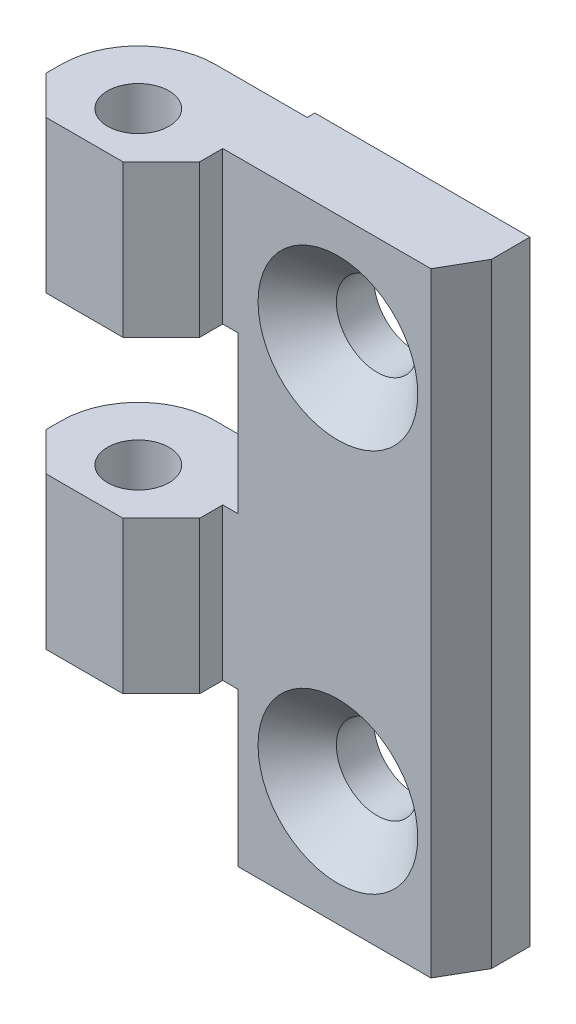
ISO-10303-21;
HEADER;
FILE_DESCRIPTION(('STEP AP214'),'2;1');
FILE_NAME('part.step','',(''),(''),'','','');
FILE_SCHEMA(('AUTOMOTIVE_DESIGN { 1 0 10303 214 1 1 1 1 }'));
ENDSEC;
DATA;
#1=APPLICATION_CONTEXT('core data for automotive mechanical design processes');
#2=APPLICATION_PROTOCOL_DEFINITION('international standard','automotive_design',2000,#1);
#3=PRODUCT_CONTEXT('',#1,'mechanical');
#4=PRODUCT('Part','Part','',(#3));
#5=PRODUCT_RELATED_PRODUCT_CATEGORY('part','',(#4));
#6=PRODUCT_DEFINITION_FORMATION('','',#4);
#7=PRODUCT_DEFINITION_CONTEXT('part definition',#1,'design');
#8=PRODUCT_DEFINITION('design','',#6,#7);
#9=PRODUCT_DEFINITION_SHAPE('','',#8);
#10=(LENGTH_UNIT() NAMED_UNIT(*) SI_UNIT(.MILLI.,.METRE.));
#11=(NAMED_UNIT(*) PLANE_ANGLE_UNIT() SI_UNIT($,.RADIAN.));
#12=(NAMED_UNIT(*) SI_UNIT($,.STERADIAN.) SOLID_ANGLE_UNIT());
#13=UNCERTAINTY_MEASURE_WITH_UNIT(LENGTH_MEASURE(1.E-05),#10,'distance_accuracy_value','');
#14=(GEOMETRIC_REPRESENTATION_CONTEXT(3) GLOBAL_UNCERTAINTY_ASSIGNED_CONTEXT((#13)) GLOBAL_UNIT_ASSIGNED_CONTEXT((#10,
#11,#12)) REPRESENTATION_CONTEXT('',''));
#15=CARTESIAN_POINT('',(0.,0.,0.));
#16=DIRECTION('',(0.,0.,1.));
#17=DIRECTION('',(1.,0.,0.));
#18=AXIS2_PLACEMENT_3D('',#15,#16,#17);
#19=CARTESIAN_POINT('',(-2.5,40.,0.));
#20=DIRECTION('',(0.707106781186548,0.,-0.707106781186548));
#21=DIRECTION('',(-0.707106781186548,0.,-0.707106781186548));
#22=AXIS2_PLACEMENT_3D('',#19,#20,#21);
#23=PLANE('',#22);
#24=DIRECTION('',(-0.707106781186548,0.,-0.707106781186548));
#25=VECTOR('',#24,1.);
#26=CARTESIAN_POINT('',(-2.5,10.,0.));
#27=LINE('',#26,#25);
#28=CARTESIAN_POINT('',(-2.5,10.,0.));
#29=VERTEX_POINT('',#28);
#30=CARTESIAN_POINT('',(-5.,10.,-2.5));
#31=VERTEX_POINT('',#30);
#32=EDGE_CURVE('E51',#29,#31,#27,.T.);
#33=ORIENTED_EDGE('',*,*,#32,.F.);
#34=DIRECTION('',(0.,-1.,0.));
#35=VECTOR('',#34,1.);
#36=CARTESIAN_POINT('',(-2.5,40.,0.));
#37=LINE('',#36,#35);
#38=CARTESIAN_POINT('',(-2.5,19.9,0.));
#39=VERTEX_POINT('',#38);
#40=EDGE_CURVE('E227',#39,#29,#37,.T.);
#41=ORIENTED_EDGE('',*,*,#40,.F.);
#42=DIRECTION('',(0.707106781186548,0.,0.707106781186548));
#43=VECTOR('',#42,1.);
#44=CARTESIAN_POINT('',(-2.5,19.9,0.));
#45=LINE('',#44,#43);
#46=CARTESIAN_POINT('',(-5.,19.9,-2.5));
#47=VERTEX_POINT('',#46);
#48=EDGE_CURVE('E247',#47,#39,#45,.T.);
#49=ORIENTED_EDGE('',*,*,#48,.F.);
#50=DIRECTION('',(0.,-1.,0.));
#51=VECTOR('',#50,1.);
#52=CARTESIAN_POINT('',(-5.,40.,-2.5));
#53=LINE('',#52,#51);
#54=EDGE_CURVE('E336',#47,#31,#53,.T.);
#55=ORIENTED_EDGE('',*,*,#54,.T.);
#56=EDGE_LOOP('',(#33,#41,#49,#55));
#57=FACE_BOUND('',#56,.T.);
#58=ADVANCED_FACE('F34',(#57),#23,.F.);
#59=CARTESIAN_POINT('',(-2.5,40.,0.));
#60=DIRECTION('',(0.,0.,-1.));
#61=DIRECTION('',(-1.,0.,0.));
#62=AXIS2_PLACEMENT_3D('',#59,#60,#61);
#63=PLANE('',#62);
#64=DIRECTION('',(-1.,0.,0.));
#65=VECTOR('',#64,1.);
#66=CARTESIAN_POINT('',(-2.5,10.,0.));
#67=LINE('',#66,#65);
#68=CARTESIAN_POINT('',(2.5,10.,0.));
#69=VERTEX_POINT('',#68);
#70=EDGE_CURVE('E428',#69,#29,#67,.T.);
#71=ORIENTED_EDGE('',*,*,#70,.F.);
#72=DIRECTION('',(0.,-1.,0.));
#73=VECTOR('',#72,1.);
#74=CARTESIAN_POINT('',(2.5,40.,0.));
#75=LINE('',#74,#73);
#76=CARTESIAN_POINT('',(2.5,19.9,0.));
#77=VERTEX_POINT('',#76);
#78=EDGE_CURVE('E223',#77,#69,#75,.T.);
#79=ORIENTED_EDGE('',*,*,#78,.F.);
#80=DIRECTION('',(1.,0.,0.));
#81=VECTOR('',#80,1.);
#82=CARTESIAN_POINT('',(-2.5,19.9,0.));
#83=LINE('',#82,#81);
#84=EDGE_CURVE('E249',#39,#77,#83,.T.);
#85=ORIENTED_EDGE('',*,*,#84,.F.);
#86=ORIENTED_EDGE('',*,*,#40,.T.);
#87=EDGE_LOOP('',(#71,#79,#85,#86));
#88=FACE_BOUND('',#87,.T.);
#89=ADVANCED_FACE('F457',(#88),#63,.F.);
#90=CARTESIAN_POINT('',(2.5,40.,0.));
#91=DIRECTION('',(-0.707106781186548,0.,-0.707106781186548));
#92=DIRECTION('',(-0.707106781186548,0.,0.707106781186548));
#93=AXIS2_PLACEMENT_3D('',#90,#91,#92);
#94=PLANE('',#93);
#95=DIRECTION('',(-0.707106781186548,0.,0.707106781186548));
#96=VECTOR('',#95,1.);
#97=CARTESIAN_POINT('',(2.5,10.,0.));
#98=LINE('',#97,#96);
#99=CARTESIAN_POINT('',(5.,10.,-2.5));
#100=VERTEX_POINT('',#99);
#101=EDGE_CURVE('E193',#100,#69,#98,.T.);
#102=ORIENTED_EDGE('',*,*,#101,.F.);
#103=DIRECTION('',(0.,-1.,0.));
#104=VECTOR('',#103,1.);
#105=CARTESIAN_POINT('',(5.,40.,-2.5));
#106=LINE('',#105,#104);
#107=CARTESIAN_POINT('',(5.,19.9,-2.5));
#108=VERTEX_POINT('',#107);
#109=EDGE_CURVE('E191',#108,#100,#106,.T.);
#110=ORIENTED_EDGE('',*,*,#109,.F.);
#111=DIRECTION('',(0.707106781186548,0.,-0.707106781186548));
#112=VECTOR('',#111,1.);
#113=CARTESIAN_POINT('',(2.5,19.9,0.));
#114=LINE('',#113,#112);
#115=EDGE_CURVE('E251',#77,#108,#114,.T.);
#116=ORIENTED_EDGE('',*,*,#115,.F.);
#117=ORIENTED_EDGE('',*,*,#78,.T.);
#118=EDGE_LOOP('',(#102,#110,#116,#117));
#119=FACE_BOUND('',#118,.T.);
#120=ADVANCED_FACE('F424',(#119),#94,.F.);
#121=CARTESIAN_POINT('',(5.,40.,-2.5));
#122=DIRECTION('',(-1.,0.,0.));
#123=DIRECTION('',(0.,0.,1.));
#124=AXIS2_PLACEMENT_3D('',#121,#122,#123);
#125=PLANE('',#124);
#126=DIRECTION('',(0.,0.,1.));
#127=VECTOR('',#126,1.);
#128=CARTESIAN_POINT('',(5.,10.,-2.5));
#129=LINE('',#128,#127);
#130=CARTESIAN_POINT('',(5.,10.,-4.));
#131=VERTEX_POINT('',#130);
#132=EDGE_CURVE('E184',#131,#100,#129,.T.);
#133=ORIENTED_EDGE('',*,*,#132,.F.);
#134=DIRECTION('',(0.,-1.,0.));
#135=VECTOR('',#134,1.);
#136=CARTESIAN_POINT('',(5.,40.,-4.));
#137=LINE('',#136,#135);
#138=CARTESIAN_POINT('',(5.,19.9,-4.));
#139=VERTEX_POINT('',#138);
#140=EDGE_CURVE('E189',#139,#131,#137,.T.);
#141=ORIENTED_EDGE('',*,*,#140,.F.);
#142=DIRECTION('',(0.,0.,-1.));
#143=VECTOR('',#142,1.);
#144=CARTESIAN_POINT('',(5.,19.9,-2.5));
#145=LINE('',#144,#143);
#146=EDGE_CURVE('E253',#108,#139,#145,.T.);
#147=ORIENTED_EDGE('',*,*,#146,.F.);
#148=ORIENTED_EDGE('',*,*,#109,.T.);
#149=EDGE_LOOP('',(#133,#141,#147,#148));
#150=FACE_BOUND('',#149,.T.);
#151=ADVANCED_FACE('F186',(#150),#125,.F.);
#152=CARTESIAN_POINT('',(0.,40.,-8.5));
#153=DIRECTION('',(0.,0.,1.));
#154=DIRECTION('',(1.,0.,0.));
#155=AXIS2_PLACEMENT_3D('',#152,#153,#154);
#156=PLANE('',#155);
#157=DIRECTION('',(-1.,0.,0.));
#158=VECTOR('',#157,1.);
#159=CARTESIAN_POINT('',(0.,10.,-8.5));
#160=LINE('',#159,#158);
#161=CARTESIAN_POINT('',(6.,10.,-8.5));
#162=VERTEX_POINT('',#161);
#163=CARTESIAN_POINT('',(0.,10.,-8.5));
#164=VERTEX_POINT('',#163);
#165=EDGE_CURVE('E235',#162,#164,#160,.T.);
#166=ORIENTED_EDGE('',*,*,#165,.T.);
#167=DIRECTION('',(0.,-1.,0.));
#168=VECTOR('',#167,1.);
#169=CARTESIAN_POINT('',(0.,40.,-8.5));
#170=LINE('',#169,#168);
#171=CARTESIAN_POINT('',(0.,19.9,-8.5));
#172=VERTEX_POINT('',#171);
#173=EDGE_CURVE('E351',#172,#164,#170,.T.);
#174=ORIENTED_EDGE('',*,*,#173,.F.);
#175=DIRECTION('',(1.,0.,0.));
#176=VECTOR('',#175,1.);
#177=CARTESIAN_POINT('',(0.,19.9,-8.5));
#178=LINE('',#177,#176);
#179=CARTESIAN_POINT('',(6.,19.9,-8.5));
#180=VERTEX_POINT('',#179);
#181=EDGE_CURVE('E43',#172,#180,#178,.T.);
#182=ORIENTED_EDGE('',*,*,#181,.T.);
#183=DIRECTION('',(0.,-1.,0.));
#184=VECTOR('',#183,1.);
#185=CARTESIAN_POINT('',(6.,40.,-8.5));
#186=LINE('',#185,#184);
#187=EDGE_CURVE('E355',#180,#162,#186,.T.);
#188=ORIENTED_EDGE('',*,*,#187,.T.);
#189=EDGE_LOOP('',(#166,#174,#182,#188));
#190=FACE_BOUND('',#189,.T.);
#191=ADVANCED_FACE('F440',(#190),#156,.F.);
#192=CARTESIAN_POINT('',(0.,40.,-3.49999999999998));
#193=DIRECTION('',(0.,-1.,0.));
#194=DIRECTION('',(0.,0.,-1.));
#195=AXIS2_PLACEMENT_3D('',#192,#193,#194);
#196=CYLINDRICAL_SURFACE('',#195,5.00000000000002);
#197=CARTESIAN_POINT('',(0.,10.,-3.49999999999998));
#198=DIRECTION('',(0.,-1.,0.));
#199=DIRECTION('',(0.,0.,-1.));
#200=AXIS2_PLACEMENT_3D('',#197,#198,#199);
#201=CIRCLE('',#200,5.00000000000002);
#202=CARTESIAN_POINT('',(-5.,10.,-3.5));
#203=VERTEX_POINT('',#202);
#204=EDGE_CURVE('E435',#203,#164,#201,.T.);
#205=ORIENTED_EDGE('',*,*,#204,.F.);
#206=DIRECTION('',(0.,-1.,0.));
#207=VECTOR('',#206,1.);
#208=CARTESIAN_POINT('',(-5.,40.,-3.5));
#209=LINE('',#208,#207);
#210=CARTESIAN_POINT('',(-5.,19.9,-3.5));
#211=VERTEX_POINT('',#210);
#212=EDGE_CURVE('E347',#211,#203,#209,.T.);
#213=ORIENTED_EDGE('',*,*,#212,.F.);
#214=CARTESIAN_POINT('',(0.,19.9,-3.49999999999998));
#215=DIRECTION('',(0.,1.,0.));
#216=DIRECTION('',(0.,0.,1.));
#217=AXIS2_PLACEMENT_3D('',#214,#215,#216);
#218=CIRCLE('',#217,5.00000000000002);
#219=EDGE_CURVE('E59',#172,#211,#218,.T.);
#220=ORIENTED_EDGE('',*,*,#219,.F.);
#221=ORIENTED_EDGE('',*,*,#173,.T.);
#222=EDGE_LOOP('',(#205,#213,#220,#221));
#223=FACE_BOUND('',#222,.T.);
#224=ADVANCED_FACE('F445',(#223),#196,.T.);
#225=CARTESIAN_POINT('',(-5.,40.,-2.5));
#226=DIRECTION('',(1.,0.,0.));
#227=DIRECTION('',(0.,0.,-1.));
#228=AXIS2_PLACEMENT_3D('',#225,#226,#227);
#229=PLANE('',#228);
#230=DIRECTION('',(0.,0.,-1.));
#231=VECTOR('',#230,1.);
#232=CARTESIAN_POINT('',(-5.,10.,-2.5));
#233=LINE('',#232,#231);
#234=EDGE_CURVE('E433',#31,#203,#233,.T.);
#235=ORIENTED_EDGE('',*,*,#234,.F.);
#236=ORIENTED_EDGE('',*,*,#54,.F.);
#237=DIRECTION('',(0.,0.,1.));
#238=VECTOR('',#237,1.);
#239=CARTESIAN_POINT('',(-5.,19.9,-2.5));
#240=LINE('',#239,#238);
#241=EDGE_CURVE('E234',#211,#47,#240,.T.);
#242=ORIENTED_EDGE('',*,*,#241,.F.);
#243=ORIENTED_EDGE('',*,*,#212,.T.);
#244=EDGE_LOOP('',(#235,#236,#242,#243));
#245=FACE_BOUND('',#244,.T.);
#246=ADVANCED_FACE('F448',(#245),#229,.F.);
#247=CARTESIAN_POINT('',(0.,0.,-3.49999999999998));
#248=DIRECTION('',(0.,1.,0.));
#249=DIRECTION('',(0.,0.,1.));
#250=AXIS2_PLACEMENT_3D('',#247,#248,#249);
#251=CYLINDRICAL_SURFACE('',#250,2.);
#252=CARTESIAN_POINT('',(0.,19.9,-3.49999999999998));
#253=DIRECTION('',(0.,1.,0.));
#254=DIRECTION('',(0.,0.,1.));
#255=AXIS2_PLACEMENT_3D('',#252,#253,#254);
#256=CIRCLE('',#255,2.);
#257=CARTESIAN_POINT('',(0.,19.9,-1.49999999999998));
#258=VERTEX_POINT('',#257);
#259=EDGE_CURVE('E232',#258,#258,#256,.F.);
#260=ORIENTED_EDGE('',*,*,#259,.F.);
#261=EDGE_LOOP('',(#260));
#262=FACE_BOUND('',#261,.T.);
#263=CARTESIAN_POINT('',(0.,10.,-3.49999999999998));
#264=DIRECTION('',(0.,-1.,0.));
#265=DIRECTION('',(0.,0.,-1.));
#266=AXIS2_PLACEMENT_3D('',#263,#264,#265);
#267=CIRCLE('',#266,2.);
#268=CARTESIAN_POINT('',(0.,10.,-5.49999999999998));
#269=VERTEX_POINT('',#268);
#270=EDGE_CURVE('E437',#269,#269,#267,.F.);
#271=ORIENTED_EDGE('',*,*,#270,.F.);
#272=EDGE_LOOP('',(#271));
#273=FACE_BOUND('',#272,.T.);
#274=ADVANCED_FACE('F469',(#262,#273),#251,.F.);
#275=DIRECTION('',(-0.707106781186548,0.,-0.707106781186548));
#276=VECTOR('',#275,1.);
#277=CARTESIAN_POINT('',(-2.5,30.1,0.));
#278=LINE('',#277,#276);
#279=CARTESIAN_POINT('',(-2.5,30.1,0.));
#280=VERTEX_POINT('',#279);
#281=CARTESIAN_POINT('',(-5.,30.1,-2.5));
#282=VERTEX_POINT('',#281);
#283=EDGE_CURVE('E260',#280,#282,#278,.T.);
#284=ORIENTED_EDGE('',*,*,#283,.F.);
#285=CARTESIAN_POINT('',(-2.5,40.,0.));
#286=VERTEX_POINT('',#285);
#287=EDGE_CURVE('E228',#286,#280,#37,.T.);
#288=ORIENTED_EDGE('',*,*,#287,.F.);
#289=DIRECTION('',(0.707106781186548,0.,0.707106781186548));
#290=VECTOR('',#289,1.);
#291=CARTESIAN_POINT('',(-2.5,40.,0.));
#292=LINE('',#291,#290);
#293=CARTESIAN_POINT('',(-5.,40.,-2.5));
#294=VERTEX_POINT('',#293);
#295=EDGE_CURVE('E311',#294,#286,#292,.T.);
#296=ORIENTED_EDGE('',*,*,#295,.F.);
#297=EDGE_CURVE('E344',#294,#282,#53,.T.);
#298=ORIENTED_EDGE('',*,*,#297,.T.);
#299=EDGE_LOOP('',(#284,#288,#296,#298));
#300=FACE_BOUND('',#299,.T.);
#301=ADVANCED_FACE('F36',(#300),#23,.F.);
#302=DIRECTION('',(-1.,0.,0.));
#303=VECTOR('',#302,1.);
#304=CARTESIAN_POINT('',(-2.5,30.1,0.));
#305=LINE('',#304,#303);
#306=CARTESIAN_POINT('',(2.5,30.1,0.));
#307=VERTEX_POINT('',#306);
#308=EDGE_CURVE('E265',#307,#280,#305,.T.);
#309=ORIENTED_EDGE('',*,*,#308,.F.);
#310=CARTESIAN_POINT('',(2.5,40.,0.));
#311=VERTEX_POINT('',#310);
#312=EDGE_CURVE('E224',#311,#307,#75,.T.);
#313=ORIENTED_EDGE('',*,*,#312,.F.);
#314=DIRECTION('',(1.,0.,0.));
#315=VECTOR('',#314,1.);
#316=CARTESIAN_POINT('',(-2.5,40.,0.));
#317=LINE('',#316,#315);
#318=EDGE_CURVE('E314',#286,#311,#317,.T.);
#319=ORIENTED_EDGE('',*,*,#318,.F.);
#320=ORIENTED_EDGE('',*,*,#287,.T.);
#321=EDGE_LOOP('',(#309,#313,#319,#320));
#322=FACE_BOUND('',#321,.T.);
#323=ADVANCED_FACE('F405',(#322),#63,.F.);
#324=DIRECTION('',(-0.707106781186548,0.,0.707106781186548));
#325=VECTOR('',#324,1.);
#326=CARTESIAN_POINT('',(2.5,30.1,0.));
#327=LINE('',#326,#325);
#328=CARTESIAN_POINT('',(5.,30.1,-2.5));
#329=VERTEX_POINT('',#328);
#330=EDGE_CURVE('E263',#329,#307,#327,.T.);
#331=ORIENTED_EDGE('',*,*,#330,.F.);
#332=CARTESIAN_POINT('',(5.,40.,-2.5));
#333=VERTEX_POINT('',#332);
#334=EDGE_CURVE('E220',#333,#329,#106,.T.);
#335=ORIENTED_EDGE('',*,*,#334,.F.);
#336=DIRECTION('',(0.707106781186548,0.,-0.707106781186548));
#337=VECTOR('',#336,1.);
#338=CARTESIAN_POINT('',(2.5,40.,0.));
#339=LINE('',#338,#337);
#340=EDGE_CURVE('E317',#311,#333,#339,.T.);
#341=ORIENTED_EDGE('',*,*,#340,.F.);
#342=ORIENTED_EDGE('',*,*,#312,.T.);
#343=EDGE_LOOP('',(#331,#335,#341,#342));
#344=FACE_BOUND('',#343,.T.);
#345=ADVANCED_FACE('F413',(#344),#94,.F.);
#346=DIRECTION('',(0.,0.,1.));
#347=VECTOR('',#346,1.);
#348=CARTESIAN_POINT('',(5.,30.1,-2.5));
#349=LINE('',#348,#347);
#350=CARTESIAN_POINT('',(5.,30.1,-4.));
#351=VERTEX_POINT('',#350);
#352=EDGE_CURVE('E261',#351,#329,#349,.T.);
#353=ORIENTED_EDGE('',*,*,#352,.F.);
#354=CARTESIAN_POINT('',(5.,40.,-4.));
#355=VERTEX_POINT('',#354);
#356=EDGE_CURVE('E211',#355,#351,#137,.T.);
#357=ORIENTED_EDGE('',*,*,#356,.F.);
#358=DIRECTION('',(0.,0.,-1.));
#359=VECTOR('',#358,1.);
#360=CARTESIAN_POINT('',(5.,40.,-2.5));
#361=LINE('',#360,#359);
#362=EDGE_CURVE('E319',#333,#355,#361,.T.);
#363=ORIENTED_EDGE('',*,*,#362,.F.);
#364=ORIENTED_EDGE('',*,*,#334,.T.);
#365=EDGE_LOOP('',(#353,#357,#363,#364));
#366=FACE_BOUND('',#365,.T.);
#367=ADVANCED_FACE('F415',(#366),#125,.F.);
#368=DIRECTION('',(-1.,0.,0.));
#369=VECTOR('',#368,1.);
#370=CARTESIAN_POINT('',(0.,30.1,-8.5));
#371=LINE('',#370,#369);
#372=CARTESIAN_POINT('',(6.,30.1,-8.5));
#373=VERTEX_POINT('',#372);
#374=CARTESIAN_POINT('',(0.,30.1,-8.5));
#375=VERTEX_POINT('',#374);
#376=EDGE_CURVE('E11',#373,#375,#371,.T.);
#377=ORIENTED_EDGE('',*,*,#376,.T.);
#378=CARTESIAN_POINT('',(0.,40.,-8.5));
#379=VERTEX_POINT('',#378);
#380=EDGE_CURVE('E352',#379,#375,#170,.T.);
#381=ORIENTED_EDGE('',*,*,#380,.F.);
#382=DIRECTION('',(-1.,0.,0.));
#383=VECTOR('',#382,1.);
#384=CARTESIAN_POINT('',(0.,40.,-8.5));
#385=LINE('',#384,#383);
#386=CARTESIAN_POINT('',(6.,40.,-8.5));
#387=VERTEX_POINT('',#386);
#388=EDGE_CURVE('E330',#387,#379,#385,.T.);
#389=ORIENTED_EDGE('',*,*,#388,.F.);
#390=EDGE_CURVE('E356',#387,#373,#186,.T.);
#391=ORIENTED_EDGE('',*,*,#390,.T.);
#392=EDGE_LOOP('',(#377,#381,#389,#391));
#393=FACE_BOUND('',#392,.T.);
#394=ADVANCED_FACE('F388',(#393),#156,.F.);
#395=CARTESIAN_POINT('',(0.,30.1,-3.49999999999998));
#396=DIRECTION('',(0.,-1.,0.));
#397=DIRECTION('',(0.,0.,-1.));
#398=AXIS2_PLACEMENT_3D('',#395,#396,#397);
#399=CIRCLE('',#398,5.00000000000002);
#400=CARTESIAN_POINT('',(-5.,30.1,-3.5));
#401=VERTEX_POINT('',#400);
#402=EDGE_CURVE('E257',#401,#375,#399,.T.);
#403=ORIENTED_EDGE('',*,*,#402,.F.);
#404=CARTESIAN_POINT('',(-5.,40.,-3.5));
#405=VERTEX_POINT('',#404);
#406=EDGE_CURVE('E348',#405,#401,#209,.T.);
#407=ORIENTED_EDGE('',*,*,#406,.F.);
#408=CARTESIAN_POINT('',(0.,40.,-3.49999999999998));
#409=DIRECTION('',(0.,1.,0.));
#410=DIRECTION('',(0.,0.,-1.));
#411=AXIS2_PLACEMENT_3D('',#408,#409,#410);
#412=CIRCLE('',#411,5.00000000000002);
#413=EDGE_CURVE('E332',#379,#405,#412,.T.);
#414=ORIENTED_EDGE('',*,*,#413,.F.);
#415=ORIENTED_EDGE('',*,*,#380,.T.);
#416=EDGE_LOOP('',(#403,#407,#414,#415));
#417=FACE_BOUND('',#416,.T.);
#418=ADVANCED_FACE('F393',(#417),#196,.T.);
#419=DIRECTION('',(0.,0.,-1.));
#420=VECTOR('',#419,1.);
#421=CARTESIAN_POINT('',(-5.,30.1,-2.5));
#422=LINE('',#421,#420);
#423=EDGE_CURVE('E255',#282,#401,#422,.T.);
#424=ORIENTED_EDGE('',*,*,#423,.F.);
#425=ORIENTED_EDGE('',*,*,#297,.F.);
#426=DIRECTION('',(0.,0.,1.));
#427=VECTOR('',#426,1.);
#428=CARTESIAN_POINT('',(-5.,40.,-2.5));
#429=LINE('',#428,#427);
#430=EDGE_CURVE('E334',#405,#294,#429,.T.);
#431=ORIENTED_EDGE('',*,*,#430,.F.);
#432=ORIENTED_EDGE('',*,*,#406,.T.);
#433=EDGE_LOOP('',(#424,#425,#431,#432));
#434=FACE_BOUND('',#433,.T.);
#435=ADVANCED_FACE('F400',(#434),#229,.F.);
#436=CARTESIAN_POINT('',(0.,40.,-3.49999999999998));
#437=DIRECTION('',(0.,1.,0.));
#438=DIRECTION('',(0.,0.,1.));
#439=AXIS2_PLACEMENT_3D('',#436,#437,#438);
#440=CIRCLE('',#439,2.);
#441=CARTESIAN_POINT('',(0.,40.,-1.49999999999998));
#442=VERTEX_POINT('',#441);
#443=EDGE_CURVE('E278',#442,#442,#440,.T.);
#444=ORIENTED_EDGE('',*,*,#443,.T.);
#445=EDGE_LOOP('',(#444));
#446=FACE_BOUND('',#445,.T.);
#447=CARTESIAN_POINT('',(0.,30.1,-3.49999999999998));
#448=DIRECTION('',(0.,-1.,0.));
#449=DIRECTION('',(0.,0.,-1.));
#450=AXIS2_PLACEMENT_3D('',#447,#448,#449);
#451=CIRCLE('',#450,2.);
#452=CARTESIAN_POINT('',(0.,30.1,-5.49999999999998));
#453=VERTEX_POINT('',#452);
#454=EDGE_CURVE('E38',#453,#453,#451,.F.);
#455=ORIENTED_EDGE('',*,*,#454,.F.);
#456=EDGE_LOOP('',(#455));
#457=FACE_BOUND('',#456,.T.);
#458=ADVANCED_FACE('F475',(#446,#457),#251,.F.);
#459=CARTESIAN_POINT('',(5.,40.,-4.));
#460=DIRECTION('',(0.,0.,-1.));
#461=DIRECTION('',(-1.,0.,0.));
#462=AXIS2_PLACEMENT_3D('',#459,#460,#461);
#463=PLANE('',#462);
#464=CARTESIAN_POINT('',(12.5,32.5,-4.));
#465=DIRECTION('',(0.,0.,1.));
#466=DIRECTION('',(1.,0.,0.));
#467=AXIS2_PLACEMENT_3D('',#464,#465,#466);
#468=CIRCLE('',#467,5.2);
#469=CARTESIAN_POINT('',(17.7,32.5,-4.));
#470=VERTEX_POINT('',#469);
#471=EDGE_CURVE('E282',#470,#470,#468,.T.);
#472=ORIENTED_EDGE('',*,*,#471,.F.);
#473=EDGE_LOOP('',(#472));
#474=FACE_BOUND('',#473,.T.);
#475=CARTESIAN_POINT('',(12.5,7.5,-4.));
#476=DIRECTION('',(0.,0.,1.));
#477=DIRECTION('',(1.,0.,0.));
#478=AXIS2_PLACEMENT_3D('',#475,#476,#477);
#479=CIRCLE('',#478,5.2);
#480=CARTESIAN_POINT('',(17.7,7.5,-4.));
#481=VERTEX_POINT('',#480);
#482=EDGE_CURVE('E291',#481,#481,#479,.T.);
#483=ORIENTED_EDGE('',*,*,#482,.F.);
#484=EDGE_LOOP('',(#483));
#485=FACE_BOUND('',#484,.T.);
#486=ORIENTED_EDGE('',*,*,#140,.T.);
#487=DIRECTION('',(-1.,0.,0.));
#488=VECTOR('',#487,1.);
#489=CARTESIAN_POINT('',(5.,10.,-4.));
#490=LINE('',#489,#488);
#491=CARTESIAN_POINT('',(6.,10.,-4.));
#492=VERTEX_POINT('',#491);
#493=EDGE_CURVE('E196',#492,#131,#490,.T.);
#494=ORIENTED_EDGE('',*,*,#493,.F.);
#495=DIRECTION('',(0.,1.,0.));
#496=VECTOR('',#495,1.);
#497=CARTESIAN_POINT('',(6.,0.,-4.));
#498=LINE('',#497,#496);
#499=CARTESIAN_POINT('',(6.,0.,-4.));
#500=VERTEX_POINT('',#499);
#501=EDGE_CURVE('E204',#500,#492,#498,.T.);
#502=ORIENTED_EDGE('',*,*,#501,.F.);
#503=DIRECTION('',(1.,0.,0.));
#504=VECTOR('',#503,1.);
#505=CARTESIAN_POINT('',(5.,0.,-4.));
#506=LINE('',#505,#504);
#507=CARTESIAN_POINT('',(18.56,0.,-4.));
#508=VERTEX_POINT('',#507);
#509=EDGE_CURVE('E309',#500,#508,#506,.T.);
#510=ORIENTED_EDGE('',*,*,#509,.T.);
#511=DIRECTION('',(0.,1.,0.));
#512=VECTOR('',#511,1.);
#513=CARTESIAN_POINT('',(18.56,0.,-4.));
#514=LINE('',#513,#512);
#515=CARTESIAN_POINT('',(18.56,40.,-4.));
#516=VERTEX_POINT('',#515);
#517=EDGE_CURVE('E306',#508,#516,#514,.T.);
#518=ORIENTED_EDGE('',*,*,#517,.T.);
#519=DIRECTION('',(1.,0.,0.));
#520=VECTOR('',#519,1.);
#521=CARTESIAN_POINT('',(5.,40.,-4.));
#522=LINE('',#521,#520);
#523=EDGE_CURVE('E321',#355,#516,#522,.T.);
#524=ORIENTED_EDGE('',*,*,#523,.F.);
#525=ORIENTED_EDGE('',*,*,#356,.T.);
#526=DIRECTION('',(-1.,0.,0.));
#527=VECTOR('',#526,1.);
#528=CARTESIAN_POINT('',(5.,30.1,-4.));
#529=LINE('',#528,#527);
#530=CARTESIAN_POINT('',(6.,30.1,-4.));
#531=VERTEX_POINT('',#530);
#532=EDGE_CURVE('E272',#531,#351,#529,.T.);
#533=ORIENTED_EDGE('',*,*,#532,.F.);
#534=DIRECTION('',(0.,1.,0.));
#535=VECTOR('',#534,1.);
#536=CARTESIAN_POINT('',(6.,30.1,-4.));
#537=LINE('',#536,#535);
#538=CARTESIAN_POINT('',(6.,19.9,-4.));
#539=VERTEX_POINT('',#538);
#540=EDGE_CURVE('E269',#539,#531,#537,.T.);
#541=ORIENTED_EDGE('',*,*,#540,.F.);
#542=DIRECTION('',(1.,0.,0.));
#543=VECTOR('',#542,1.);
#544=CARTESIAN_POINT('',(5.,19.9,-4.));
#545=LINE('',#544,#543);
#546=EDGE_CURVE('E210',#139,#539,#545,.T.);
#547=ORIENTED_EDGE('',*,*,#546,.F.);
#548=EDGE_LOOP('',(#486,#494,#502,#510,#518,#524,#525,#533,#541,#547));
#549=FACE_BOUND('',#548,.T.);
#550=ADVANCED_FACE('F207',(#474,#485,#549),#463,.F.);
#551=CARTESIAN_POINT('',(20.,40.,-9.));
#552=DIRECTION('',(-1.,0.,0.));
#553=DIRECTION('',(0.,0.,1.));
#554=AXIS2_PLACEMENT_3D('',#551,#552,#553);
#555=PLANE('',#554);
#556=DIRECTION('',(0.,0.,-1.));
#557=VECTOR('',#556,1.);
#558=CARTESIAN_POINT('',(20.,40.,-9.));
#559=LINE('',#558,#557);
#560=CARTESIAN_POINT('',(20.,40.,-6.5));
#561=VERTEX_POINT('',#560);
#562=CARTESIAN_POINT('',(20.,40.,-9.));
#563=VERTEX_POINT('',#562);
#564=EDGE_CURVE('E324',#561,#563,#559,.T.);
#565=ORIENTED_EDGE('',*,*,#564,.F.);
#566=DIRECTION('',(0.,1.,0.));
#567=VECTOR('',#566,1.);
#568=CARTESIAN_POINT('',(20.,0.,-6.5));
#569=LINE('',#568,#567);
#570=CARTESIAN_POINT('',(20.,0.,-6.5));
#571=VERTEX_POINT('',#570);
#572=EDGE_CURVE('E304',#571,#561,#569,.T.);
#573=ORIENTED_EDGE('',*,*,#572,.F.);
#574=DIRECTION('',(0.,0.,-1.));
#575=VECTOR('',#574,1.);
#576=CARTESIAN_POINT('',(20.,0.,-9.));
#577=LINE('',#576,#575);
#578=CARTESIAN_POINT('',(20.,0.,-9.));
#579=VERTEX_POINT('',#578);
#580=EDGE_CURVE('E338',#571,#579,#577,.T.);
#581=ORIENTED_EDGE('',*,*,#580,.T.);
#582=DIRECTION('',(0.,-1.,0.));
#583=VECTOR('',#582,1.);
#584=CARTESIAN_POINT('',(20.,40.,-9.));
#585=LINE('',#584,#583);
#586=EDGE_CURVE('E212',#563,#579,#585,.T.);
#587=ORIENTED_EDGE('',*,*,#586,.F.);
#588=EDGE_LOOP('',(#565,#573,#581,#587));
#589=FACE_BOUND('',#588,.T.);
#590=ADVANCED_FACE('F383',(#589),#555,.F.);
#591=CARTESIAN_POINT('',(6.,40.,-9.));
#592=DIRECTION('',(0.,0.,1.));
#593=DIRECTION('',(1.,0.,0.));
#594=AXIS2_PLACEMENT_3D('',#591,#592,#593);
#595=PLANE('',#594);
#596=CARTESIAN_POINT('',(12.5,32.5,-9.));
#597=DIRECTION('',(0.,0.,1.));
#598=DIRECTION('',(1.,0.,0.));
#599=AXIS2_PLACEMENT_3D('',#596,#597,#598);
#600=CIRCLE('',#599,2.65);
#601=CARTESIAN_POINT('',(15.15,32.5,-9.));
#602=VERTEX_POINT('',#601);
#603=EDGE_CURVE('E288',#602,#602,#600,.T.);
#604=ORIENTED_EDGE('',*,*,#603,.T.);
#605=EDGE_LOOP('',(#604));
#606=FACE_BOUND('',#605,.T.);
#607=CARTESIAN_POINT('',(12.5,7.5,-9.));
#608=DIRECTION('',(0.,0.,1.));
#609=DIRECTION('',(1.,0.,0.));
#610=AXIS2_PLACEMENT_3D('',#607,#608,#609);
#611=CIRCLE('',#610,2.65);
#612=CARTESIAN_POINT('',(15.15,7.5,-9.));
#613=VERTEX_POINT('',#612);
#614=EDGE_CURVE('E297',#613,#613,#611,.T.);
#615=ORIENTED_EDGE('',*,*,#614,.T.);
#616=EDGE_LOOP('',(#615));
#617=FACE_BOUND('',#616,.T.);
#618=DIRECTION('',(-1.,0.,0.));
#619=VECTOR('',#618,1.);
#620=CARTESIAN_POINT('',(6.,0.,-9.));
#621=LINE('',#620,#619);
#622=CARTESIAN_POINT('',(6.,0.,-9.));
#623=VERTEX_POINT('',#622);
#624=EDGE_CURVE('E340',#579,#623,#621,.T.);
#625=ORIENTED_EDGE('',*,*,#624,.T.);
#626=DIRECTION('',(0.,-1.,0.));
#627=VECTOR('',#626,1.);
#628=CARTESIAN_POINT('',(6.,40.,-9.));
#629=LINE('',#628,#627);
#630=CARTESIAN_POINT('',(6.,40.,-9.));
#631=VERTEX_POINT('',#630);
#632=EDGE_CURVE('E216',#631,#623,#629,.T.);
#633=ORIENTED_EDGE('',*,*,#632,.F.);
#634=DIRECTION('',(-1.,0.,0.));
#635=VECTOR('',#634,1.);
#636=CARTESIAN_POINT('',(6.,40.,-9.));
#637=LINE('',#636,#635);
#638=EDGE_CURVE('E326',#563,#631,#637,.T.);
#639=ORIENTED_EDGE('',*,*,#638,.F.);
#640=ORIENTED_EDGE('',*,*,#586,.T.);
#641=EDGE_LOOP('',(#625,#633,#639,#640));
#642=FACE_BOUND('',#641,.T.);
#643=ADVANCED_FACE('F367',(#606,#617,#642),#595,.F.);
#644=CARTESIAN_POINT('',(6.,40.,-8.5));
#645=DIRECTION('',(1.,0.,0.));
#646=DIRECTION('',(0.,0.,-1.));
#647=AXIS2_PLACEMENT_3D('',#644,#645,#646);
#648=PLANE('',#647);
#649=DIRECTION('',(0.,0.,1.));
#650=VECTOR('',#649,1.);
#651=CARTESIAN_POINT('',(6.,10.,-14.));
#652=LINE('',#651,#650);
#653=EDGE_CURVE('E200',#162,#492,#652,.T.);
#654=ORIENTED_EDGE('',*,*,#653,.F.);
#655=ORIENTED_EDGE('',*,*,#187,.F.);
#656=DIRECTION('',(0.,0.,1.));
#657=VECTOR('',#656,1.);
#658=CARTESIAN_POINT('',(6.,19.9,-14.));
#659=LINE('',#658,#657);
#660=EDGE_CURVE('E275',#180,#539,#659,.T.);
#661=ORIENTED_EDGE('',*,*,#660,.T.);
#662=ORIENTED_EDGE('',*,*,#540,.T.);
#663=DIRECTION('',(0.,0.,1.));
#664=VECTOR('',#663,1.);
#665=CARTESIAN_POINT('',(6.,30.1,-14.));
#666=LINE('',#665,#664);
#667=EDGE_CURVE('E276',#373,#531,#666,.T.);
#668=ORIENTED_EDGE('',*,*,#667,.F.);
#669=ORIENTED_EDGE('',*,*,#390,.F.);
#670=DIRECTION('',(0.,0.,1.));
#671=VECTOR('',#670,1.);
#672=CARTESIAN_POINT('',(6.,40.,-8.5));
#673=LINE('',#672,#671);
#674=EDGE_CURVE('E328',#631,#387,#673,.T.);
#675=ORIENTED_EDGE('',*,*,#674,.F.);
#676=ORIENTED_EDGE('',*,*,#632,.T.);
#677=DIRECTION('',(0.,0.,1.));
#678=VECTOR('',#677,1.);
#679=CARTESIAN_POINT('',(6.,0.,-8.5));
#680=LINE('',#679,#678);
#681=EDGE_CURVE('E315',#623,#500,#680,.T.);
#682=ORIENTED_EDGE('',*,*,#681,.T.);
#683=ORIENTED_EDGE('',*,*,#501,.T.);
#684=EDGE_LOOP('',(#654,#655,#661,#662,#668,#669,#675,#676,#682,#683));
#685=FACE_BOUND('',#684,.T.);
#686=ADVANCED_FACE('F361',(#685),#648,.F.);
#687=CARTESIAN_POINT('',(0.,40.,-3.49999999999998));
#688=DIRECTION('',(0.,-1.,0.));
#689=DIRECTION('',(0.,0.,-1.));
#690=AXIS2_PLACEMENT_3D('',#687,#688,#689);
#691=PLANE('',#690);
#692=ORIENTED_EDGE('',*,*,#443,.F.);
#693=EDGE_LOOP('',(#692));
#694=FACE_BOUND('',#693,.T.);
#695=ORIENTED_EDGE('',*,*,#523,.T.);
#696=DIRECTION('',(-0.499122205111676,0.,0.86653160609666));
#697=VECTOR('',#696,1.);
#698=CARTESIAN_POINT('',(20.,40.,-6.5));
#699=LINE('',#698,#697);
#700=EDGE_CURVE('E300',#561,#516,#699,.T.);
#701=ORIENTED_EDGE('',*,*,#700,.F.);
#702=ORIENTED_EDGE('',*,*,#564,.T.);
#703=ORIENTED_EDGE('',*,*,#638,.T.);
#704=ORIENTED_EDGE('',*,*,#674,.T.);
#705=ORIENTED_EDGE('',*,*,#388,.T.);
#706=ORIENTED_EDGE('',*,*,#413,.T.);
#707=ORIENTED_EDGE('',*,*,#430,.T.);
#708=ORIENTED_EDGE('',*,*,#295,.T.);
#709=ORIENTED_EDGE('',*,*,#318,.T.);
#710=ORIENTED_EDGE('',*,*,#340,.T.);
#711=ORIENTED_EDGE('',*,*,#362,.T.);
#712=EDGE_LOOP('',(#695,#701,#702,#703,#704,#705,#706,#707,#708,#709,#710,#711));
#713=FACE_BOUND('',#712,.T.);
#714=ADVANCED_FACE('F381',(#694,#713),#691,.F.);
#715=CARTESIAN_POINT('',(0.,0.,-3.49999999999998));
#716=DIRECTION('',(0.,-1.,0.));
#717=DIRECTION('',(0.,0.,-1.));
#718=AXIS2_PLACEMENT_3D('',#715,#716,#717);
#719=PLANE('',#718);
#720=ORIENTED_EDGE('',*,*,#509,.F.);
#721=ORIENTED_EDGE('',*,*,#681,.F.);
#722=ORIENTED_EDGE('',*,*,#624,.F.);
#723=ORIENTED_EDGE('',*,*,#580,.F.);
#724=DIRECTION('',(-0.499122205111676,0.,0.86653160609666));
#725=VECTOR('',#724,1.);
#726=CARTESIAN_POINT('',(20.,0.,-6.5));
#727=LINE('',#726,#725);
#728=EDGE_CURVE('E301',#571,#508,#727,.T.);
#729=ORIENTED_EDGE('',*,*,#728,.T.);
#730=EDGE_LOOP('',(#720,#721,#722,#723,#729));
#731=FACE_BOUND('',#730,.T.);
#732=ADVANCED_FACE('F372',(#731),#719,.T.);
#733=CARTESIAN_POINT('',(20.,0.,-6.5));
#734=DIRECTION('',(-0.86653160609666,0.,-0.499122205111676));
#735=DIRECTION('',(-0.499122205111676,0.,0.86653160609666));
#736=AXIS2_PLACEMENT_3D('',#733,#734,#735);
#737=PLANE('',#736);
#738=ORIENTED_EDGE('',*,*,#700,.T.);
#739=ORIENTED_EDGE('',*,*,#517,.F.);
#740=ORIENTED_EDGE('',*,*,#728,.F.);
#741=ORIENTED_EDGE('',*,*,#572,.T.);
#742=EDGE_LOOP('',(#738,#739,#740,#741));
#743=FACE_BOUND('',#742,.T.);
#744=ADVANCED_FACE('F376',(#743),#737,.F.);
#745=CARTESIAN_POINT('',(12.5,7.5,-4.));
#746=DIRECTION('',(0.,0.,1.));
#747=DIRECTION('',(1.,0.,0.));
#748=AXIS2_PLACEMENT_3D('',#745,#746,#747);
#749=CYLINDRICAL_SURFACE('',#748,2.65);
#750=ORIENTED_EDGE('',*,*,#614,.F.);
#751=EDGE_LOOP('',(#750));
#752=FACE_BOUND('',#751,.T.);
#753=CARTESIAN_POINT('',(12.5,7.5,-6.55));
#754=DIRECTION('',(0.,0.,1.));
#755=DIRECTION('',(1.,0.,0.));
#756=AXIS2_PLACEMENT_3D('',#753,#754,#755);
#757=CIRCLE('',#756,2.65);
#758=CARTESIAN_POINT('',(15.15,7.5,-6.55));
#759=VERTEX_POINT('',#758);
#760=EDGE_CURVE('E294',#759,#759,#757,.T.);
#761=ORIENTED_EDGE('',*,*,#760,.T.);
#762=EDGE_LOOP('',(#761));
#763=FACE_BOUND('',#762,.T.);
#764=ADVANCED_FACE('F696',(#752,#763),#749,.F.);
#765=CARTESIAN_POINT('',(12.5,7.5,-4.));
#766=DIRECTION('',(0.,0.,1.));
#767=DIRECTION('',(1.,0.,0.));
#768=AXIS2_PLACEMENT_3D('',#765,#766,#767);
#769=CONICAL_SURFACE('',#768,5.2,0.785398163397448);
#770=ORIENTED_EDGE('',*,*,#760,.F.);
#771=EDGE_LOOP('',(#770));
#772=FACE_BOUND('',#771,.T.);
#773=ORIENTED_EDGE('',*,*,#482,.T.);
#774=EDGE_LOOP('',(#773));
#775=FACE_BOUND('',#774,.T.);
#776=ADVANCED_FACE('F687',(#772,#775),#769,.F.);
#777=CARTESIAN_POINT('',(12.5,32.5,-4.));
#778=DIRECTION('',(0.,0.,1.));
#779=DIRECTION('',(1.,0.,0.));
#780=AXIS2_PLACEMENT_3D('',#777,#778,#779);
#781=CYLINDRICAL_SURFACE('',#780,2.65);
#782=ORIENTED_EDGE('',*,*,#603,.F.);
#783=EDGE_LOOP('',(#782));
#784=FACE_BOUND('',#783,.T.);
#785=CARTESIAN_POINT('',(12.5,32.5,-6.55));
#786=DIRECTION('',(0.,0.,1.));
#787=DIRECTION('',(1.,0.,0.));
#788=AXIS2_PLACEMENT_3D('',#785,#786,#787);
#789=CIRCLE('',#788,2.65);
#790=CARTESIAN_POINT('',(15.15,32.5,-6.55));
#791=VERTEX_POINT('',#790);
#792=EDGE_CURVE('E285',#791,#791,#789,.T.);
#793=ORIENTED_EDGE('',*,*,#792,.T.);
#794=EDGE_LOOP('',(#793));
#795=FACE_BOUND('',#794,.T.);
#796=ADVANCED_FACE('F502',(#784,#795),#781,.F.);
#797=CARTESIAN_POINT('',(12.5,32.5,-4.));
#798=DIRECTION('',(0.,0.,1.));
#799=DIRECTION('',(1.,0.,0.));
#800=AXIS2_PLACEMENT_3D('',#797,#798,#799);
#801=CONICAL_SURFACE('',#800,5.2,0.785398163397449);
#802=ORIENTED_EDGE('',*,*,#792,.F.);
#803=EDGE_LOOP('',(#802));
#804=FACE_BOUND('',#803,.T.);
#805=ORIENTED_EDGE('',*,*,#471,.T.);
#806=EDGE_LOOP('',(#805));
#807=FACE_BOUND('',#806,.T.);
#808=ADVANCED_FACE('F496',(#804,#807),#801,.F.);
#809=CARTESIAN_POINT('',(5.,30.1,-14.));
#810=DIRECTION('',(0.,1.,0.));
#811=DIRECTION('',(0.,0.,1.));
#812=AXIS2_PLACEMENT_3D('',#809,#810,#811);
#813=PLANE('',#812);
#814=ORIENTED_EDGE('',*,*,#667,.T.);
#815=ORIENTED_EDGE('',*,*,#532,.T.);
#816=ORIENTED_EDGE('',*,*,#352,.T.);
#817=ORIENTED_EDGE('',*,*,#330,.T.);
#818=ORIENTED_EDGE('',*,*,#308,.T.);
#819=ORIENTED_EDGE('',*,*,#283,.T.);
#820=ORIENTED_EDGE('',*,*,#423,.T.);
#821=ORIENTED_EDGE('',*,*,#402,.T.);
#822=ORIENTED_EDGE('',*,*,#376,.F.);
#823=EDGE_LOOP('',(#814,#815,#816,#817,#818,#819,#820,#821,#822));
#824=FACE_BOUND('',#823,.T.);
#825=ORIENTED_EDGE('',*,*,#454,.T.);
#826=EDGE_LOOP('',(#825));
#827=FACE_BOUND('',#826,.T.);
#828=ADVANCED_FACE('F418',(#824,#827),#813,.F.);
#829=CARTESIAN_POINT('',(5.,19.9,-14.));
#830=DIRECTION('',(0.,-1.,0.));
#831=DIRECTION('',(0.,0.,-1.));
#832=AXIS2_PLACEMENT_3D('',#829,#830,#831);
#833=PLANE('',#832);
#834=ORIENTED_EDGE('',*,*,#181,.F.);
#835=ORIENTED_EDGE('',*,*,#219,.T.);
#836=ORIENTED_EDGE('',*,*,#241,.T.);
#837=ORIENTED_EDGE('',*,*,#48,.T.);
#838=ORIENTED_EDGE('',*,*,#84,.T.);
#839=ORIENTED_EDGE('',*,*,#115,.T.);
#840=ORIENTED_EDGE('',*,*,#146,.T.);
#841=ORIENTED_EDGE('',*,*,#546,.T.);
#842=ORIENTED_EDGE('',*,*,#660,.F.);
#843=EDGE_LOOP('',(#834,#835,#836,#837,#838,#839,#840,#841,#842));
#844=FACE_BOUND('',#843,.T.);
#845=ORIENTED_EDGE('',*,*,#259,.T.);
#846=EDGE_LOOP('',(#845));
#847=FACE_BOUND('',#846,.T.);
#848=ADVANCED_FACE('F421',(#844,#847),#833,.F.);
#849=CARTESIAN_POINT('',(5.,10.,-14.));
#850=DIRECTION('',(0.,1.,0.));
#851=DIRECTION('',(0.,0.,1.));
#852=AXIS2_PLACEMENT_3D('',#849,#850,#851);
#853=PLANE('',#852);
#854=ORIENTED_EDGE('',*,*,#653,.T.);
#855=ORIENTED_EDGE('',*,*,#493,.T.);
#856=ORIENTED_EDGE('',*,*,#132,.T.);
#857=ORIENTED_EDGE('',*,*,#101,.T.);
#858=ORIENTED_EDGE('',*,*,#70,.T.);
#859=ORIENTED_EDGE('',*,*,#32,.T.);
#860=ORIENTED_EDGE('',*,*,#234,.T.);
#861=ORIENTED_EDGE('',*,*,#204,.T.);
#862=ORIENTED_EDGE('',*,*,#165,.F.);
#863=EDGE_LOOP('',(#854,#855,#856,#857,#858,#859,#860,#861,#862));
#864=FACE_BOUND('',#863,.T.);
#865=ORIENTED_EDGE('',*,*,#270,.T.);
#866=EDGE_LOOP('',(#865));
#867=FACE_BOUND('',#866,.T.);
#868=ADVANCED_FACE('F197',(#864,#867),#853,.F.);
#869=CLOSED_SHELL('',(#58,#89,#120,#151,#191,#224,#246,#274,#301,#323,#345,#367,#394,#418,#435,
#458,#550,#590,#643,#686,#714,#732,#744,#764,#776,#796,#808,#828,#848,#868));
#870=MANIFOLD_SOLID_BREP('B2',#869);
#871=ADVANCED_BREP_SHAPE_REPRESENTATION('',(#18,#870),#14);
#872=SHAPE_DEFINITION_REPRESENTATION(#9,#871);
ENDSEC;
END-ISO-10303-21;
